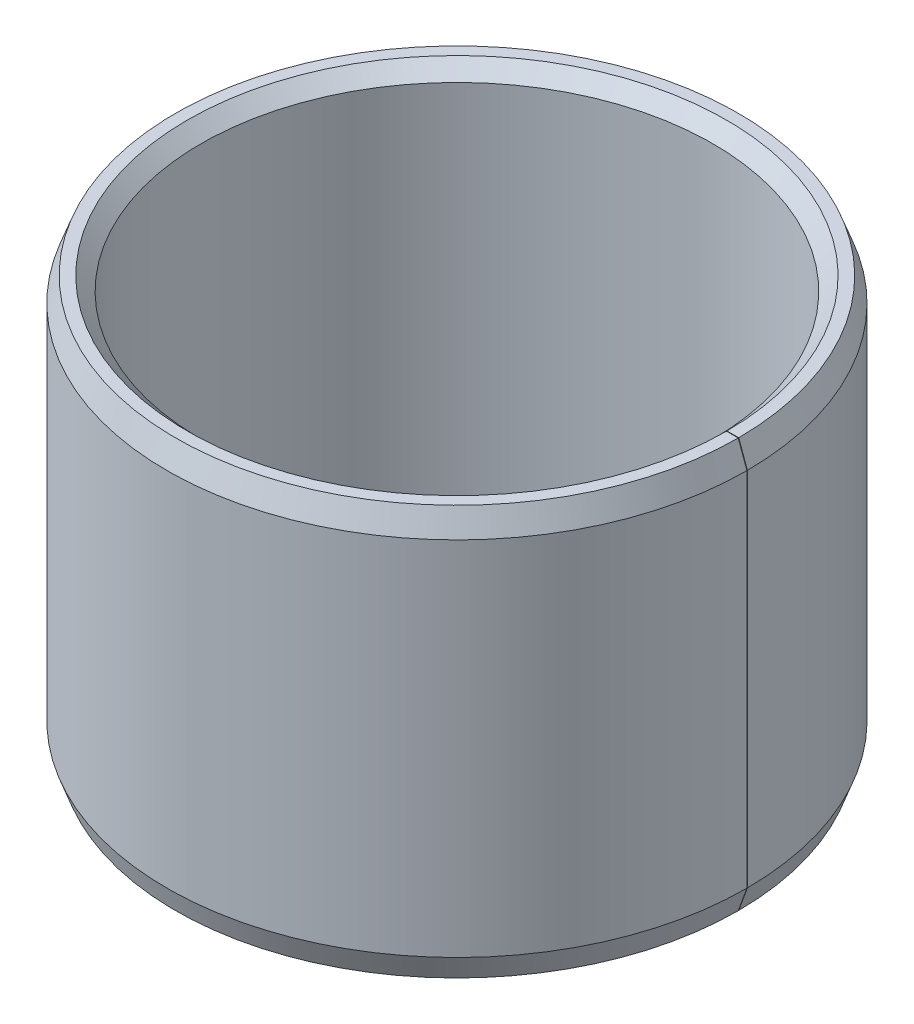
ISO-10303-21;
HEADER;
FILE_DESCRIPTION(('STEP AP214'),'2;1');
FILE_NAME('part.step','',(''),(''),'','','');
FILE_SCHEMA(('AUTOMOTIVE_DESIGN { 1 0 10303 214 1 1 1 1 }'));
ENDSEC;
DATA;
#1=APPLICATION_CONTEXT('core data for automotive mechanical design processes');
#2=APPLICATION_PROTOCOL_DEFINITION('international standard','automotive_design',2000,#1);
#3=PRODUCT_CONTEXT('',#1,'mechanical');
#4=PRODUCT('Part','Part','',(#3));
#5=PRODUCT_RELATED_PRODUCT_CATEGORY('part','',(#4));
#6=PRODUCT_DEFINITION_FORMATION('','',#4);
#7=PRODUCT_DEFINITION_CONTEXT('part definition',#1,'design');
#8=PRODUCT_DEFINITION('design','',#6,#7);
#9=PRODUCT_DEFINITION_SHAPE('','',#8);
#10=(LENGTH_UNIT() NAMED_UNIT(*) SI_UNIT(.MILLI.,.METRE.));
#11=(NAMED_UNIT(*) PLANE_ANGLE_UNIT() SI_UNIT($,.RADIAN.));
#12=(NAMED_UNIT(*) SI_UNIT($,.STERADIAN.) SOLID_ANGLE_UNIT());
#13=UNCERTAINTY_MEASURE_WITH_UNIT(LENGTH_MEASURE(1.E-05),#10,'distance_accuracy_value','');
#14=(GEOMETRIC_REPRESENTATION_CONTEXT(3) GLOBAL_UNCERTAINTY_ASSIGNED_CONTEXT((#13)) GLOBAL_UNIT_ASSIGNED_CONTEXT((#10,
#11,#12)) REPRESENTATION_CONTEXT('',''));
#15=CARTESIAN_POINT('',(0.,0.,0.));
#16=DIRECTION('',(0.,0.,1.));
#17=DIRECTION('',(1.,0.,0.));
#18=AXIS2_PLACEMENT_3D('',#15,#16,#17);
#19=CARTESIAN_POINT('',(0.,30.,0.));
#20=DIRECTION('',(0.,0.999999999999998,0.));
#21=DIRECTION('',(0.,0.,1.));
#22=AXIS2_PLACEMENT_3D('',#19,#20,#21);
#23=CYLINDRICAL_SURFACE('',#22,7.5);
#24=DIRECTION('',(0.,-0.999999999999998,0.));
#25=VECTOR('',#24,1.);
#26=CARTESIAN_POINT('',(7.49998857684964,12.,-0.0130899627441283));
#27=LINE('',#26,#25);
#28=CARTESIAN_POINT('',(7.49998857684966,11.6,-0.0130899627441006));
#29=VERTEX_POINT('',#28);
#30=CARTESIAN_POINT('',(7.49998857684964,0.400000000000053,-0.0130899627441006));
#31=VERTEX_POINT('',#30);
#32=EDGE_CURVE('E171',#29,#31,#27,.T.);
#33=ORIENTED_EDGE('',*,*,#32,.F.);
#34=CARTESIAN_POINT('',(0.,11.6,0.));
#35=DIRECTION('',(0.,-0.999999999999998,0.));
#36=DIRECTION('',(0.,0.,-1.));
#37=AXIS2_PLACEMENT_3D('',#34,#35,#36);
#38=CIRCLE('',#37,7.5);
#39=CARTESIAN_POINT('',(7.50000000000003,11.6,0.));
#40=VERTEX_POINT('',#39);
#41=EDGE_CURVE('E155',#29,#40,#38,.F.);
#42=ORIENTED_EDGE('',*,*,#41,.T.);
#43=DIRECTION('',(0.,-0.999999999999998,0.));
#44=VECTOR('',#43,1.);
#45=CARTESIAN_POINT('',(7.50000000000001,12.,0.));
#46=LINE('',#45,#44);
#47=CARTESIAN_POINT('',(7.49999999999998,0.400000000000005,0.));
#48=VERTEX_POINT('',#47);
#49=EDGE_CURVE('E185',#40,#48,#46,.T.);
#50=ORIENTED_EDGE('',*,*,#49,.T.);
#51=CARTESIAN_POINT('',(0.,0.400000000000046,0.));
#52=DIRECTION('',(0.,0.999999999999998,0.));
#53=DIRECTION('',(0.,0.,1.));
#54=AXIS2_PLACEMENT_3D('',#51,#52,#53);
#55=CIRCLE('',#54,7.5);
#56=EDGE_CURVE('E152',#48,#31,#55,.F.);
#57=ORIENTED_EDGE('',*,*,#56,.T.);
#58=EDGE_LOOP('',(#33,#42,#50,#57));
#59=FACE_BOUND('',#58,.T.);
#60=ADVANCED_FACE('F40',(#59),#23,.F.);
#61=CARTESIAN_POINT('',(7.49998857684966,0.,-0.0130899627441006));
#62=DIRECTION('',(0.,0.999999999999998,0.));
#63=DIRECTION('',(0.,0.,1.));
#64=AXIS2_PLACEMENT_3D('',#61,#62,#63);
#65=PLANE('',#64);
#66=DIRECTION('',(0.999998476913287,0.,-0.00174532836588448));
#67=VECTOR('',#66,1.);
#68=CARTESIAN_POINT('',(7.49998857684966,0.,-0.0130899627441006));
#69=LINE('',#68,#67);
#70=CARTESIAN_POINT('',(7.89998796761498,0.,-0.0137880940904445));
#71=VERTEX_POINT('',#70);
#72=CARTESIAN_POINT('',(8.24520827782735,0.,-0.0143906178081132));
#73=VERTEX_POINT('',#72);
#74=EDGE_CURVE('E179',#71,#73,#69,.T.);
#75=ORIENTED_EDGE('',*,*,#74,.F.);
#76=CARTESIAN_POINT('',(0.,0.,0.));
#77=DIRECTION('',(0.,0.999999999999998,0.));
#78=DIRECTION('',(0.,0.,1.));
#79=AXIS2_PLACEMENT_3D('',#76,#77,#78);
#80=CIRCLE('',#79,7.90000000000001);
#81=CARTESIAN_POINT('',(7.9,0.,0.));
#82=VERTEX_POINT('',#81);
#83=EDGE_CURVE('E11',#71,#82,#80,.T.);
#84=ORIENTED_EDGE('',*,*,#83,.T.);
#85=DIRECTION('',(0.999999999999999,0.,0.));
#86=VECTOR('',#85,1.);
#87=CARTESIAN_POINT('',(7.50000000000001,0.,0.));
#88=LINE('',#87,#86);
#89=CARTESIAN_POINT('',(8.24522083601362,0.,0.));
#90=VERTEX_POINT('',#89);
#91=EDGE_CURVE('E192',#82,#90,#88,.T.);
#92=ORIENTED_EDGE('',*,*,#91,.T.);
#93=CARTESIAN_POINT('',(0.,0.,0.));
#94=DIRECTION('',(0.,0.999999999999998,0.));
#95=DIRECTION('',(0.,0.,1.));
#96=AXIS2_PLACEMENT_3D('',#93,#94,#95);
#97=CIRCLE('',#96,8.24522083601366);
#98=EDGE_CURVE('E118',#90,#73,#97,.F.);
#99=ORIENTED_EDGE('',*,*,#98,.T.);
#100=EDGE_LOOP('',(#75,#84,#92,#99));
#101=FACE_BOUND('',#100,.T.);
#102=ADVANCED_FACE('F42',(#101),#65,.F.);
#103=CARTESIAN_POINT('',(0.,30.,0.));
#104=DIRECTION('',(0.,0.999999999999998,0.));
#105=DIRECTION('',(0.,0.,1.));
#106=AXIS2_PLACEMENT_3D('',#103,#104,#105);
#107=CYLINDRICAL_SURFACE('',#106,8.5);
#108=DIRECTION('',(0.,0.999999999999998,0.));
#109=VECTOR('',#108,1.);
#110=CARTESIAN_POINT('',(8.50000000000001,12.,0.));
#111=LINE('',#110,#109);
#112=CARTESIAN_POINT('',(8.49999999999999,0.700000000000069,0.));
#113=VERTEX_POINT('',#112);
#114=CARTESIAN_POINT('',(8.50000000000001,11.3,0.));
#115=VERTEX_POINT('',#114);
#116=EDGE_CURVE('E187',#113,#115,#111,.T.);
#117=ORIENTED_EDGE('',*,*,#116,.T.);
#118=CARTESIAN_POINT('',(0.,11.3,0.));
#119=DIRECTION('',(0.,-0.999999999999998,0.));
#120=DIRECTION('',(0.,0.,-1.));
#121=AXIS2_PLACEMENT_3D('',#118,#119,#120);
#122=CIRCLE('',#121,8.5);
#123=CARTESIAN_POINT('',(8.4999870537629,11.3,-0.0148352911100158));
#124=VERTEX_POINT('',#123);
#125=EDGE_CURVE('E144',#115,#124,#122,.T.);
#126=ORIENTED_EDGE('',*,*,#125,.T.);
#127=DIRECTION('',(0.,0.999999999999998,0.));
#128=VECTOR('',#127,1.);
#129=CARTESIAN_POINT('',(8.49998705376297,12.,-0.014835291109988));
#130=LINE('',#129,#128);
#131=CARTESIAN_POINT('',(8.49998705376294,0.700000000000069,-0.014835291109988));
#132=VERTEX_POINT('',#131);
#133=EDGE_CURVE('E113',#132,#124,#130,.T.);
#134=ORIENTED_EDGE('',*,*,#133,.F.);
#135=CARTESIAN_POINT('',(0.,0.700000000000055,0.));
#136=DIRECTION('',(0.,0.999999999999998,0.));
#137=DIRECTION('',(0.,0.,1.));
#138=AXIS2_PLACEMENT_3D('',#135,#136,#137);
#139=CIRCLE('',#138,8.5);
#140=EDGE_CURVE('E140',#132,#113,#139,.T.);
#141=ORIENTED_EDGE('',*,*,#140,.T.);
#142=EDGE_LOOP('',(#117,#126,#134,#141));
#143=FACE_BOUND('',#142,.T.);
#144=ADVANCED_FACE('F212',(#143),#107,.T.);
#145=CARTESIAN_POINT('',(7.49998857684964,12.,-0.0130899627441283));
#146=DIRECTION('',(0.,-0.999999999999998,0.));
#147=DIRECTION('',(0.,0.,-1.));
#148=AXIS2_PLACEMENT_3D('',#145,#146,#147);
#149=PLANE('',#148);
#150=DIRECTION('',(-0.999999999999999,0.,0.));
#151=VECTOR('',#150,1.);
#152=CARTESIAN_POINT('',(7.50000000000001,12.,0.));
#153=LINE('',#152,#151);
#154=CARTESIAN_POINT('',(8.24522083601367,12.,0.));
#155=VERTEX_POINT('',#154);
#156=CARTESIAN_POINT('',(7.90000000000002,12.,0.));
#157=VERTEX_POINT('',#156);
#158=EDGE_CURVE('E180',#155,#157,#153,.T.);
#159=ORIENTED_EDGE('',*,*,#158,.T.);
#160=CARTESIAN_POINT('',(0.,12.,0.));
#161=DIRECTION('',(0.,-0.999999999999998,0.));
#162=DIRECTION('',(0.,0.,-1.));
#163=AXIS2_PLACEMENT_3D('',#160,#161,#162);
#164=CIRCLE('',#163,7.90000000000001);
#165=CARTESIAN_POINT('',(7.89998796761496,12.,-0.0137880940905));
#166=VERTEX_POINT('',#165);
#167=EDGE_CURVE('E64',#157,#166,#164,.T.);
#168=ORIENTED_EDGE('',*,*,#167,.T.);
#169=DIRECTION('',(-0.999998476913287,0.,0.00174532836588448));
#170=VECTOR('',#169,1.);
#171=CARTESIAN_POINT('',(7.49998857684964,12.,-0.0130899627441283));
#172=LINE('',#171,#170);
#173=CARTESIAN_POINT('',(8.24520827782735,12.,-0.0143906178080855));
#174=VERTEX_POINT('',#173);
#175=EDGE_CURVE('E110',#174,#166,#172,.T.);
#176=ORIENTED_EDGE('',*,*,#175,.F.);
#177=CARTESIAN_POINT('',(0.,12.,0.));
#178=DIRECTION('',(0.,-0.999999999999998,0.));
#179=DIRECTION('',(0.,0.,-1.));
#180=AXIS2_PLACEMENT_3D('',#177,#178,#179);
#181=CIRCLE('',#180,8.24522083601366);
#182=EDGE_CURVE('E123',#174,#155,#181,.F.);
#183=ORIENTED_EDGE('',*,*,#182,.T.);
#184=EDGE_LOOP('',(#159,#168,#176,#183));
#185=FACE_BOUND('',#184,.T.);
#186=ADVANCED_FACE('F122',(#185),#149,.F.);
#187=CARTESIAN_POINT('',(7.49998857684966,0.,-0.0130899627441006));
#188=DIRECTION('',(0.00174532836588556,0.,0.999998476913287));
#189=DIRECTION('',(0.999998476913287,0.,-0.00174532836588448));
#190=AXIS2_PLACEMENT_3D('',#187,#188,#189);
#191=PLANE('',#190);
#192=ORIENTED_EDGE('',*,*,#175,.T.);
#193=DIRECTION('',(0.707105704201609,0.707106781186542,-0.00123413352291384));
#194=VECTOR('',#193,1.);
#195=CARTESIAN_POINT('',(0.,4.10000000000013,0.));
#196=LINE('',#195,#194);
#197=EDGE_CURVE('E49',#166,#29,#196,.F.);
#198=ORIENTED_EDGE('',*,*,#197,.T.);
#199=ORIENTED_EDGE('',*,*,#32,.T.);
#200=DIRECTION('',(-0.707105704201606,0.707106781186545,0.00123413352291429));
#201=VECTOR('',#200,1.);
#202=CARTESIAN_POINT('',(0.,7.90000000000003,0.));
#203=LINE('',#202,#201);
#204=EDGE_CURVE('E56',#31,#71,#203,.F.);
#205=ORIENTED_EDGE('',*,*,#204,.T.);
#206=ORIENTED_EDGE('',*,*,#74,.T.);
#207=DIRECTION('',(0.342019622399338,0.939692620785905,-0.000596937457849833));
#208=VECTOR('',#207,1.);
#209=CARTESIAN_POINT('',(0.,-22.6535580653638,0.));
#210=LINE('',#209,#208);
#211=EDGE_CURVE('E119',#73,#132,#210,.T.);
#212=ORIENTED_EDGE('',*,*,#211,.T.);
#213=ORIENTED_EDGE('',*,*,#133,.T.);
#214=DIRECTION('',(-0.342019622399338,0.939692620785905,0.00059693745785061));
#215=VECTOR('',#214,1.);
#216=CARTESIAN_POINT('',(0.,34.6535580653639,0.));
#217=LINE('',#216,#215);
#218=EDGE_CURVE('E108',#124,#174,#217,.T.);
#219=ORIENTED_EDGE('',*,*,#218,.T.);
#220=EDGE_LOOP('',(#192,#198,#199,#205,#206,#212,#213,#219));
#221=FACE_BOUND('',#220,.T.);
#222=ADVANCED_FACE('F109',(#221),#191,.T.);
#223=CARTESIAN_POINT('',(7.50000000000001,0.,0.));
#224=DIRECTION('',(0.,0.,1.));
#225=DIRECTION('',(0.999999999999999,0.,0.));
#226=AXIS2_PLACEMENT_3D('',#223,#224,#225);
#227=PLANE('',#226);
#228=ORIENTED_EDGE('',*,*,#49,.F.);
#229=DIRECTION('',(0.707106781186551,0.707106781186542,0.));
#230=VECTOR('',#229,1.);
#231=CARTESIAN_POINT('',(0.,4.10000000000013,0.));
#232=LINE('',#231,#230);
#233=EDGE_CURVE('E162',#40,#157,#232,.T.);
#234=ORIENTED_EDGE('',*,*,#233,.T.);
#235=ORIENTED_EDGE('',*,*,#158,.F.);
#236=DIRECTION('',(-0.342020143325674,0.939692620785905,0.));
#237=VECTOR('',#236,1.);
#238=CARTESIAN_POINT('',(0.,34.6535580653639,0.));
#239=LINE('',#238,#237);
#240=EDGE_CURVE('E128',#155,#115,#239,.F.);
#241=ORIENTED_EDGE('',*,*,#240,.T.);
#242=ORIENTED_EDGE('',*,*,#116,.F.);
#243=DIRECTION('',(0.342020143325674,0.939692620785905,0.));
#244=VECTOR('',#243,1.);
#245=CARTESIAN_POINT('',(0.,-22.6535580653638,0.));
#246=LINE('',#245,#244);
#247=EDGE_CURVE('E130',#113,#90,#246,.F.);
#248=ORIENTED_EDGE('',*,*,#247,.T.);
#249=ORIENTED_EDGE('',*,*,#91,.F.);
#250=DIRECTION('',(-0.707106781186549,0.707106781186545,0.));
#251=VECTOR('',#250,1.);
#252=CARTESIAN_POINT('',(0.,7.90000000000003,0.));
#253=LINE('',#252,#251);
#254=EDGE_CURVE('E159',#82,#48,#253,.T.);
#255=ORIENTED_EDGE('',*,*,#254,.T.);
#256=EDGE_LOOP('',(#228,#234,#235,#241,#242,#248,#249,#255));
#257=FACE_BOUND('',#256,.T.);
#258=ADVANCED_FACE('F184',(#257),#227,.F.);
#259=CARTESIAN_POINT('',(0.,12.,0.));
#260=DIRECTION('',(0.,-0.999999999999998,0.));
#261=DIRECTION('',(0.,0.,-1.));
#262=AXIS2_PLACEMENT_3D('',#259,#260,#261);
#263=CONICAL_SURFACE('',#262,8.24522083601366,0.349065850398872);
#264=ORIENTED_EDGE('',*,*,#218,.F.);
#265=ORIENTED_EDGE('',*,*,#125,.F.);
#266=ORIENTED_EDGE('',*,*,#240,.F.);
#267=ORIENTED_EDGE('',*,*,#182,.F.);
#268=EDGE_LOOP('',(#264,#265,#266,#267));
#269=FACE_BOUND('',#268,.T.);
#270=ADVANCED_FACE('F127',(#269),#263,.T.);
#271=CARTESIAN_POINT('',(0.,0.700000000000055,0.));
#272=DIRECTION('',(0.,0.999999999999998,0.));
#273=DIRECTION('',(0.,0.,1.));
#274=AXIS2_PLACEMENT_3D('',#271,#272,#273);
#275=CONICAL_SURFACE('',#274,8.5,0.349065850398872);
#276=ORIENTED_EDGE('',*,*,#211,.F.);
#277=ORIENTED_EDGE('',*,*,#98,.F.);
#278=ORIENTED_EDGE('',*,*,#247,.F.);
#279=ORIENTED_EDGE('',*,*,#140,.F.);
#280=EDGE_LOOP('',(#276,#277,#278,#279));
#281=FACE_BOUND('',#280,.T.);
#282=ADVANCED_FACE('F209',(#281),#275,.T.);
#283=CARTESIAN_POINT('',(0.,11.6,0.));
#284=DIRECTION('',(0.,0.999999999999998,0.));
#285=DIRECTION('',(0.,0.,1.));
#286=AXIS2_PLACEMENT_3D('',#283,#284,#285);
#287=CONICAL_SURFACE('',#286,7.5,0.785398163397455);
#288=ORIENTED_EDGE('',*,*,#197,.F.);
#289=ORIENTED_EDGE('',*,*,#167,.F.);
#290=ORIENTED_EDGE('',*,*,#233,.F.);
#291=ORIENTED_EDGE('',*,*,#41,.F.);
#292=EDGE_LOOP('',(#288,#289,#290,#291));
#293=FACE_BOUND('',#292,.T.);
#294=ADVANCED_FACE('F182',(#293),#287,.F.);
#295=CARTESIAN_POINT('',(0.,0.,0.));
#296=DIRECTION('',(0.,-0.999999999999998,0.));
#297=DIRECTION('',(0.,0.,-1.));
#298=AXIS2_PLACEMENT_3D('',#295,#296,#297);
#299=CONICAL_SURFACE('',#298,7.90000000000001,0.78539816339745);
#300=ORIENTED_EDGE('',*,*,#204,.F.);
#301=ORIENTED_EDGE('',*,*,#56,.F.);
#302=ORIENTED_EDGE('',*,*,#254,.F.);
#303=ORIENTED_EDGE('',*,*,#83,.F.);
#304=EDGE_LOOP('',(#300,#301,#302,#303));
#305=FACE_BOUND('',#304,.T.);
#306=ADVANCED_FACE('F219',(#305),#299,.F.);
#307=CLOSED_SHELL('',(#60,#102,#144,#186,#222,#258,#270,#282,#294,#306));
#308=MANIFOLD_SOLID_BREP('B2',#307);
#309=ADVANCED_BREP_SHAPE_REPRESENTATION('',(#18,#308),#14);
#310=SHAPE_DEFINITION_REPRESENTATION(#9,#309);
ENDSEC;
END-ISO-10303-21;
